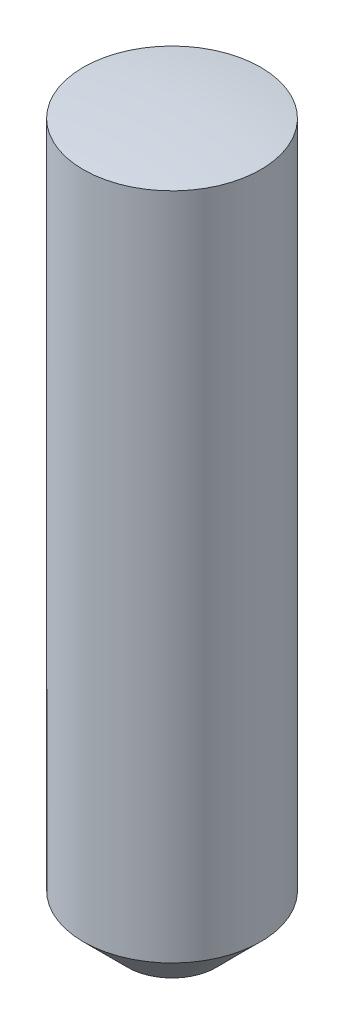
ISO-10303-21;
HEADER;
FILE_DESCRIPTION(('STEP AP214'),'2;1');
FILE_NAME('part.step','',(''),(''),'','','');
FILE_SCHEMA(('AUTOMOTIVE_DESIGN { 1 0 10303 214 1 1 1 1 }'));
ENDSEC;
DATA;
#1=APPLICATION_CONTEXT('core data for automotive mechanical design processes');
#2=APPLICATION_PROTOCOL_DEFINITION('international standard','automotive_design',2000,#1);
#3=PRODUCT_CONTEXT('',#1,'mechanical');
#4=PRODUCT('Part','Part','',(#3));
#5=PRODUCT_RELATED_PRODUCT_CATEGORY('part','',(#4));
#6=PRODUCT_DEFINITION_FORMATION('','',#4);
#7=PRODUCT_DEFINITION_CONTEXT('part definition',#1,'design');
#8=PRODUCT_DEFINITION('design','',#6,#7);
#9=PRODUCT_DEFINITION_SHAPE('','',#8);
#10=(LENGTH_UNIT() NAMED_UNIT(*) SI_UNIT(.MILLI.,.METRE.));
#11=(NAMED_UNIT(*) PLANE_ANGLE_UNIT() SI_UNIT($,.RADIAN.));
#12=(NAMED_UNIT(*) SI_UNIT($,.STERADIAN.) SOLID_ANGLE_UNIT());
#13=UNCERTAINTY_MEASURE_WITH_UNIT(LENGTH_MEASURE(1.E-05),#10,'distance_accuracy_value','');
#14=(GEOMETRIC_REPRESENTATION_CONTEXT(3) GLOBAL_UNCERTAINTY_ASSIGNED_CONTEXT((#13)) GLOBAL_UNIT_ASSIGNED_CONTEXT((#10,
#11,#12)) REPRESENTATION_CONTEXT('',''));
#15=CARTESIAN_POINT('',(0.,0.,0.));
#16=DIRECTION('',(0.,0.,1.));
#17=DIRECTION('',(1.,0.,0.));
#18=AXIS2_PLACEMENT_3D('',#15,#16,#17);
#19=CARTESIAN_POINT('',(0.,-8.1,0.));
#20=DIRECTION('',(0.,1.,0.));
#21=DIRECTION('',(0.,0.,1.));
#22=AXIS2_PLACEMENT_3D('',#19,#20,#21);
#23=CYLINDRICAL_SURFACE('',#22,1.);
#24=CARTESIAN_POINT('',(0.,-7.6,0.));
#25=DIRECTION('',(0.,1.,0.));
#26=DIRECTION('',(0.,0.,1.));
#27=AXIS2_PLACEMENT_3D('',#24,#25,#26);
#28=CIRCLE('',#27,1.);
#29=CARTESIAN_POINT('',(0.,-7.6,1.));
#30=VERTEX_POINT('',#29);
#31=EDGE_CURVE('E41',#30,#30,#28,.T.);
#32=ORIENTED_EDGE('',*,*,#31,.T.);
#33=EDGE_LOOP('',(#32));
#34=FACE_BOUND('',#33,.T.);
#35=CARTESIAN_POINT('',(0.,-0.0627460668062279,0.));
#36=DIRECTION('',(0.,-1.,0.));
#37=DIRECTION('',(0.,0.,-1.));
#38=AXIS2_PLACEMENT_3D('',#35,#36,#37);
#39=CIRCLE('',#38,1.);
#40=CARTESIAN_POINT('',(0.,-0.0627460668062279,-1.));
#41=VERTEX_POINT('',#40);
#42=EDGE_CURVE('E37',#41,#41,#39,.T.);
#43=ORIENTED_EDGE('',*,*,#42,.T.);
#44=EDGE_LOOP('',(#43));
#45=FACE_BOUND('',#44,.T.);
#46=ADVANCED_FACE('F33',(#34,#45),#23,.T.);
#47=CARTESIAN_POINT('',(0.,-8.1,0.));
#48=DIRECTION('',(0.,1.,0.));
#49=DIRECTION('',(0.,0.,1.));
#50=AXIS2_PLACEMENT_3D('',#47,#48,#49);
#51=PLANE('',#50);
#52=CARTESIAN_POINT('',(0.,-8.1,0.));
#53=DIRECTION('',(0.,1.,0.));
#54=DIRECTION('',(0.,0.,1.));
#55=AXIS2_PLACEMENT_3D('',#52,#53,#54);
#56=CIRCLE('',#55,0.499999999999998);
#57=CARTESIAN_POINT('',(0.,-8.1,0.499999999999998));
#58=VERTEX_POINT('',#57);
#59=EDGE_CURVE('E11',#58,#58,#56,.F.);
#60=ORIENTED_EDGE('',*,*,#59,.T.);
#61=EDGE_LOOP('',(#60));
#62=FACE_BOUND('',#61,.T.);
#63=ADVANCED_FACE('F57',(#62),#51,.F.);
#64=CARTESIAN_POINT('',(0.,-7.6,0.));
#65=DIRECTION('',(0.,1.,0.));
#66=DIRECTION('',(0.,0.,1.));
#67=AXIS2_PLACEMENT_3D('',#64,#65,#66);
#68=CONICAL_SURFACE('',#67,1.,0.785398163397451);
#69=ORIENTED_EDGE('',*,*,#59,.F.);
#70=EDGE_LOOP('',(#69));
#71=FACE_BOUND('',#70,.T.);
#72=ORIENTED_EDGE('',*,*,#31,.F.);
#73=EDGE_LOOP('',(#72));
#74=FACE_BOUND('',#73,.T.);
#75=ADVANCED_FACE('F35',(#71,#74),#68,.T.);
#76=CARTESIAN_POINT('',(0.,-8.,0.));
#77=DIRECTION('',(0.,-1.,0.));
#78=DIRECTION('',(-1.,0.,0.));
#79=AXIS2_PLACEMENT_3D('',#76,#77,#78);
#80=SPHERICAL_SURFACE('',#79,8.);
#81=CARTESIAN_POINT('',(0.,0.,0.));
#82=VERTEX_POINT('',#81);
#83=VERTEX_LOOP('',#82);
#84=FACE_BOUND('',#83,.T.);
#85=ORIENTED_EDGE('',*,*,#42,.F.);
#86=EDGE_LOOP('',(#85));
#87=FACE_BOUND('',#86,.T.);
#88=ADVANCED_FACE('F44',(#84,#87),#80,.T.);
#89=CLOSED_SHELL('',(#46,#63,#75,#88));
#90=MANIFOLD_SOLID_BREP('B2',#89);
#91=ADVANCED_BREP_SHAPE_REPRESENTATION('',(#18,#90),#14);
#92=SHAPE_DEFINITION_REPRESENTATION(#9,#91);
ENDSEC;
END-ISO-10303-21;
